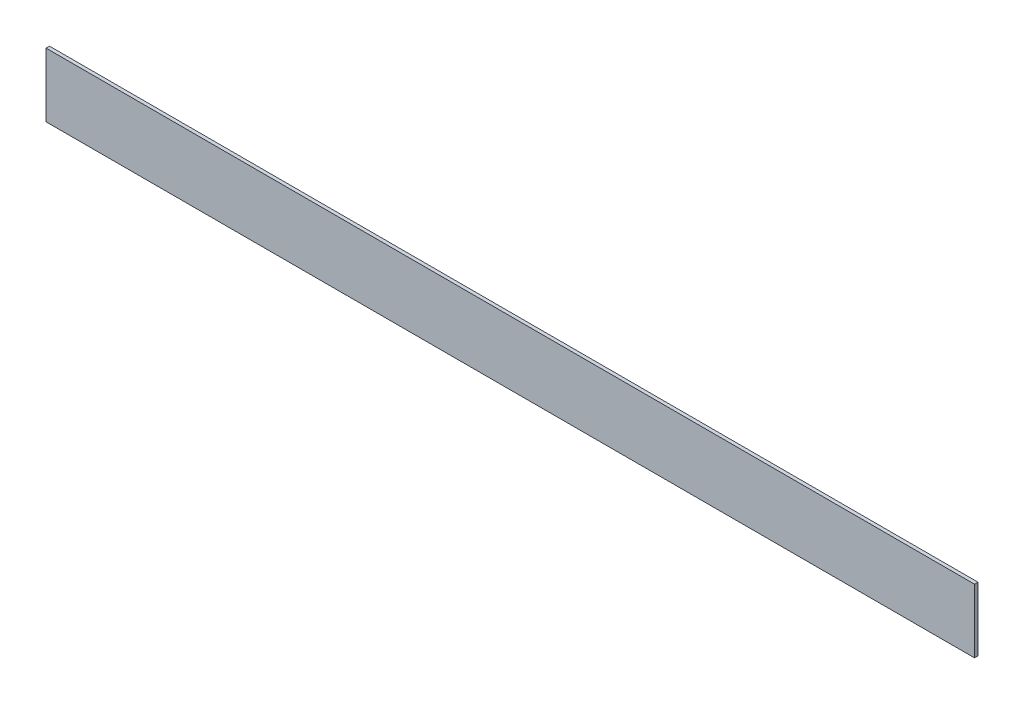
ISO-10303-21;
HEADER;
FILE_DESCRIPTION(('STEP AP214'),'2;1');
FILE_NAME('part.step','',(''),(''),'','','');
FILE_SCHEMA(('AUTOMOTIVE_DESIGN { 1 0 10303 214 1 1 1 1 }'));
ENDSEC;
DATA;
#1=APPLICATION_CONTEXT('core data for automotive mechanical design processes');
#2=APPLICATION_PROTOCOL_DEFINITION('international standard','automotive_design',2000,#1);
#3=PRODUCT_CONTEXT('',#1,'mechanical');
#4=PRODUCT('Part','Part','',(#3));
#5=PRODUCT_RELATED_PRODUCT_CATEGORY('part','',(#4));
#6=PRODUCT_DEFINITION_FORMATION('','',#4);
#7=PRODUCT_DEFINITION_CONTEXT('part definition',#1,'design');
#8=PRODUCT_DEFINITION('design','',#6,#7);
#9=PRODUCT_DEFINITION_SHAPE('','',#8);
#10=(LENGTH_UNIT() NAMED_UNIT(*) SI_UNIT(.MILLI.,.METRE.));
#11=(NAMED_UNIT(*) PLANE_ANGLE_UNIT() SI_UNIT($,.RADIAN.));
#12=(NAMED_UNIT(*) SI_UNIT($,.STERADIAN.) SOLID_ANGLE_UNIT());
#13=UNCERTAINTY_MEASURE_WITH_UNIT(LENGTH_MEASURE(1.E-05),#10,'distance_accuracy_value','');
#14=(GEOMETRIC_REPRESENTATION_CONTEXT(3) GLOBAL_UNCERTAINTY_ASSIGNED_CONTEXT((#13)) GLOBAL_UNIT_ASSIGNED_CONTEXT((#10,
#11,#12)) REPRESENTATION_CONTEXT('',''));
#15=CARTESIAN_POINT('',(0.,0.,0.));
#16=DIRECTION('',(0.,0.,1.));
#17=DIRECTION('',(1.,0.,0.));
#18=AXIS2_PLACEMENT_3D('',#15,#16,#17);
#19=CARTESIAN_POINT('',(-269.,1428.00371745928,491.160869776899));
#20=DIRECTION('',(0.,0.,-1.));
#21=DIRECTION('',(-1.,0.,0.));
#22=AXIS2_PLACEMENT_3D('',#19,#20,#21);
#23=PLANE('',#22);
#24=DIRECTION('',(-1.,0.,0.));
#25=VECTOR('',#24,1.);
#26=CARTESIAN_POINT('',(-269.,890.,491.160869776899));
#27=LINE('',#26,#25);
#28=CARTESIAN_POINT('',(-269.,890.,491.160869776899));
#29=VERTEX_POINT('',#28);
#30=CARTESIAN_POINT('',(269.,890.,491.160869776899));
#31=VERTEX_POINT('',#30);
#32=EDGE_CURVE('E74',#29,#31,#27,.F.);
#33=ORIENTED_EDGE('',*,*,#32,.F.);
#34=DIRECTION('',(0.,-1.,0.));
#35=VECTOR('',#34,1.);
#36=CARTESIAN_POINT('',(-269.,1428.00371745928,491.160869776899));
#37=LINE('',#36,#35);
#38=CARTESIAN_POINT('',(-269.,853.,491.160869776899));
#39=VERTEX_POINT('',#38);
#40=EDGE_CURVE('E58',#29,#39,#37,.T.);
#41=ORIENTED_EDGE('',*,*,#40,.T.);
#42=DIRECTION('',(1.,0.,0.));
#43=VECTOR('',#42,1.);
#44=CARTESIAN_POINT('',(-269.,853.,491.160869776899));
#45=LINE('',#44,#43);
#46=CARTESIAN_POINT('',(269.,853.,491.160869776899));
#47=VERTEX_POINT('',#46);
#48=EDGE_CURVE('E85',#39,#47,#45,.T.);
#49=ORIENTED_EDGE('',*,*,#48,.T.);
#50=DIRECTION('',(0.,-1.,0.));
#51=VECTOR('',#50,1.);
#52=CARTESIAN_POINT('',(269.,1428.00371745928,491.160869776899));
#53=LINE('',#52,#51);
#54=EDGE_CURVE('E11',#31,#47,#53,.T.);
#55=ORIENTED_EDGE('',*,*,#54,.F.);
#56=EDGE_LOOP('',(#33,#41,#49,#55));
#57=FACE_BOUND('',#56,.T.);
#58=ADVANCED_FACE('F36',(#57),#23,.F.);
#59=CARTESIAN_POINT('',(269.,1428.00371745928,489.160869776899));
#60=DIRECTION('',(1.,0.,0.));
#61=DIRECTION('',(0.,0.,-1.));
#62=AXIS2_PLACEMENT_3D('',#59,#60,#61);
#63=PLANE('',#62);
#64=DIRECTION('',(0.,-1.,0.));
#65=VECTOR('',#64,1.);
#66=CARTESIAN_POINT('',(269.,1428.00371745928,489.160869776899));
#67=LINE('',#66,#65);
#68=CARTESIAN_POINT('',(269.,890.,489.160869776899));
#69=VERTEX_POINT('',#68);
#70=CARTESIAN_POINT('',(269.,853.,489.160869776899));
#71=VERTEX_POINT('',#70);
#72=EDGE_CURVE('E43',#69,#71,#67,.T.);
#73=ORIENTED_EDGE('',*,*,#72,.F.);
#74=DIRECTION('',(0.,0.,-1.));
#75=VECTOR('',#74,1.);
#76=CARTESIAN_POINT('',(269.,890.,489.160869776899));
#77=LINE('',#76,#75);
#78=EDGE_CURVE('E77',#69,#31,#77,.F.);
#79=ORIENTED_EDGE('',*,*,#78,.T.);
#80=ORIENTED_EDGE('',*,*,#54,.T.);
#81=DIRECTION('',(0.,0.,1.));
#82=VECTOR('',#81,1.);
#83=CARTESIAN_POINT('',(269.,853.,489.160869776899));
#84=LINE('',#83,#82);
#85=EDGE_CURVE('E91',#71,#47,#84,.T.);
#86=ORIENTED_EDGE('',*,*,#85,.F.);
#87=EDGE_LOOP('',(#73,#79,#80,#86));
#88=FACE_BOUND('',#87,.T.);
#89=ADVANCED_FACE('F83',(#88),#63,.T.);
#90=CARTESIAN_POINT('',(-269.,1428.00371745928,489.160869776899));
#91=DIRECTION('',(0.,0.,-1.));
#92=DIRECTION('',(-1.,0.,0.));
#93=AXIS2_PLACEMENT_3D('',#90,#91,#92);
#94=PLANE('',#93);
#95=DIRECTION('',(0.,-1.,0.));
#96=VECTOR('',#95,1.);
#97=CARTESIAN_POINT('',(-269.,1428.00371745928,489.160869776899));
#98=LINE('',#97,#96);
#99=CARTESIAN_POINT('',(-269.,890.,489.160869776899));
#100=VERTEX_POINT('',#99);
#101=CARTESIAN_POINT('',(-269.,853.,489.160869776899));
#102=VERTEX_POINT('',#101);
#103=EDGE_CURVE('E104',#100,#102,#98,.T.);
#104=ORIENTED_EDGE('',*,*,#103,.F.);
#105=DIRECTION('',(-1.,0.,0.));
#106=VECTOR('',#105,1.);
#107=CARTESIAN_POINT('',(-269.,890.,489.160869776899));
#108=LINE('',#107,#106);
#109=EDGE_CURVE('E50',#100,#69,#108,.F.);
#110=ORIENTED_EDGE('',*,*,#109,.T.);
#111=ORIENTED_EDGE('',*,*,#72,.T.);
#112=DIRECTION('',(1.,0.,0.));
#113=VECTOR('',#112,1.);
#114=CARTESIAN_POINT('',(-269.,853.,489.160869776899));
#115=LINE('',#114,#113);
#116=EDGE_CURVE('E96',#102,#71,#115,.T.);
#117=ORIENTED_EDGE('',*,*,#116,.F.);
#118=EDGE_LOOP('',(#104,#110,#111,#117));
#119=FACE_BOUND('',#118,.T.);
#120=ADVANCED_FACE('F107',(#119),#94,.T.);
#121=CARTESIAN_POINT('',(-269.,1428.00371745928,491.160869776899));
#122=DIRECTION('',(-1.,0.,0.));
#123=DIRECTION('',(0.,0.,1.));
#124=AXIS2_PLACEMENT_3D('',#121,#122,#123);
#125=PLANE('',#124);
#126=ORIENTED_EDGE('',*,*,#40,.F.);
#127=DIRECTION('',(0.,0.,-1.));
#128=VECTOR('',#127,1.);
#129=CARTESIAN_POINT('',(-269.,890.,489.160869776899));
#130=LINE('',#129,#128);
#131=EDGE_CURVE('E78',#100,#29,#130,.F.);
#132=ORIENTED_EDGE('',*,*,#131,.F.);
#133=ORIENTED_EDGE('',*,*,#103,.T.);
#134=DIRECTION('',(0.,0.,-1.));
#135=VECTOR('',#134,1.);
#136=CARTESIAN_POINT('',(-269.,853.,491.160869776899));
#137=LINE('',#136,#135);
#138=EDGE_CURVE('E98',#39,#102,#137,.T.);
#139=ORIENTED_EDGE('',*,*,#138,.F.);
#140=EDGE_LOOP('',(#126,#132,#133,#139));
#141=FACE_BOUND('',#140,.T.);
#142=ADVANCED_FACE('F110',(#141),#125,.T.);
#143=CARTESIAN_POINT('',(0.,853.,0.));
#144=DIRECTION('',(0.,-1.,0.));
#145=DIRECTION('',(-1.,0.,0.));
#146=AXIS2_PLACEMENT_3D('',#143,#144,#145);
#147=PLANE('',#146);
#148=ORIENTED_EDGE('',*,*,#48,.F.);
#149=ORIENTED_EDGE('',*,*,#138,.T.);
#150=ORIENTED_EDGE('',*,*,#116,.T.);
#151=ORIENTED_EDGE('',*,*,#85,.T.);
#152=EDGE_LOOP('',(#148,#149,#150,#151));
#153=FACE_BOUND('',#152,.T.);
#154=ADVANCED_FACE('F94',(#153),#147,.T.);
#155=CARTESIAN_POINT('',(-269.,890.,489.160869776899));
#156=DIRECTION('',(0.,-1.,0.));
#157=DIRECTION('',(-1.,0.,0.));
#158=AXIS2_PLACEMENT_3D('',#155,#156,#157);
#159=PLANE('',#158);
#160=ORIENTED_EDGE('',*,*,#78,.F.);
#161=ORIENTED_EDGE('',*,*,#109,.F.);
#162=ORIENTED_EDGE('',*,*,#131,.T.);
#163=ORIENTED_EDGE('',*,*,#32,.T.);
#164=EDGE_LOOP('',(#160,#161,#162,#163));
#165=FACE_BOUND('',#164,.T.);
#166=ADVANCED_FACE('F76',(#165),#159,.F.);
#167=CLOSED_SHELL('',(#58,#89,#120,#142,#154,#166));
#168=MANIFOLD_SOLID_BREP('B2',#167);
#169=ADVANCED_BREP_SHAPE_REPRESENTATION('',(#18,#168),#14);
#170=SHAPE_DEFINITION_REPRESENTATION(#9,#169);
ENDSEC;
END-ISO-10303-21;
